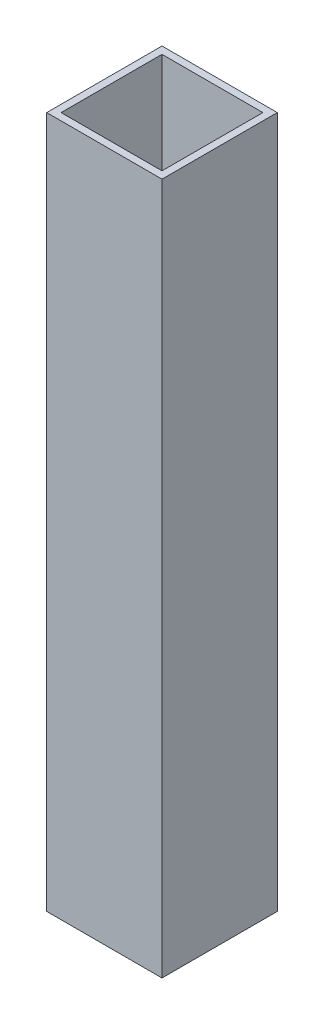
ISO-10303-21;
HEADER;
FILE_DESCRIPTION(('STEP AP214'),'2;1');
FILE_NAME('part.step','',(''),(''),'','','');
FILE_SCHEMA(('AUTOMOTIVE_DESIGN { 1 0 10303 214 1 1 1 1 }'));
ENDSEC;
DATA;
#1=APPLICATION_CONTEXT('core data for automotive mechanical design processes');
#2=APPLICATION_PROTOCOL_DEFINITION('international standard','automotive_design',2000,#1);
#3=PRODUCT_CONTEXT('',#1,'mechanical');
#4=PRODUCT('Part','Part','',(#3));
#5=PRODUCT_RELATED_PRODUCT_CATEGORY('part','',(#4));
#6=PRODUCT_DEFINITION_FORMATION('','',#4);
#7=PRODUCT_DEFINITION_CONTEXT('part definition',#1,'design');
#8=PRODUCT_DEFINITION('design','',#6,#7);
#9=PRODUCT_DEFINITION_SHAPE('','',#8);
#10=(LENGTH_UNIT() NAMED_UNIT(*) SI_UNIT(.MILLI.,.METRE.));
#11=(NAMED_UNIT(*) PLANE_ANGLE_UNIT() SI_UNIT($,.RADIAN.));
#12=(NAMED_UNIT(*) SI_UNIT($,.STERADIAN.) SOLID_ANGLE_UNIT());
#13=UNCERTAINTY_MEASURE_WITH_UNIT(LENGTH_MEASURE(1.E-05),#10,'distance_accuracy_value','');
#14=(GEOMETRIC_REPRESENTATION_CONTEXT(3) GLOBAL_UNCERTAINTY_ASSIGNED_CONTEXT((#13)) GLOBAL_UNIT_ASSIGNED_CONTEXT((#10,
#11,#12)) REPRESENTATION_CONTEXT('',''));
#15=CARTESIAN_POINT('',(0.,0.,0.));
#16=DIRECTION('',(0.,0.,1.));
#17=DIRECTION('',(1.,0.,0.));
#18=AXIS2_PLACEMENT_3D('',#15,#16,#17);
#19=CARTESIAN_POINT('',(0.,152.4,0.));
#20=DIRECTION('',(0.,1.,0.));
#21=DIRECTION('',(0.,0.,1.));
#22=AXIS2_PLACEMENT_3D('',#19,#20,#21);
#23=PLANE('',#22);
#24=DIRECTION('',(0.,0.,-1.));
#25=VECTOR('',#24,1.);
#26=CARTESIAN_POINT('',(12.7,152.4,-12.7));
#27=LINE('',#26,#25);
#28=CARTESIAN_POINT('',(12.7,152.4,12.7));
#29=VERTEX_POINT('',#28);
#30=CARTESIAN_POINT('',(12.7,152.4,-12.7));
#31=VERTEX_POINT('',#30);
#32=EDGE_CURVE('E136',#29,#31,#27,.T.);
#33=ORIENTED_EDGE('',*,*,#32,.T.);
#34=DIRECTION('',(-1.,0.,0.));
#35=VECTOR('',#34,1.);
#36=CARTESIAN_POINT('',(-12.7,152.4,-12.7));
#37=LINE('',#36,#35);
#38=CARTESIAN_POINT('',(-12.7,152.4,-12.7));
#39=VERTEX_POINT('',#38);
#40=EDGE_CURVE('E139',#31,#39,#37,.T.);
#41=ORIENTED_EDGE('',*,*,#40,.T.);
#42=DIRECTION('',(0.,0.,1.));
#43=VECTOR('',#42,1.);
#44=CARTESIAN_POINT('',(-12.7,152.4,-12.7));
#45=LINE('',#44,#43);
#46=CARTESIAN_POINT('',(-12.7,152.4,12.7));
#47=VERTEX_POINT('',#46);
#48=EDGE_CURVE('E142',#39,#47,#45,.T.);
#49=ORIENTED_EDGE('',*,*,#48,.T.);
#50=DIRECTION('',(1.,0.,0.));
#51=VECTOR('',#50,1.);
#52=CARTESIAN_POINT('',(-12.7,152.4,12.7));
#53=LINE('',#52,#51);
#54=EDGE_CURVE('E144',#47,#29,#53,.T.);
#55=ORIENTED_EDGE('',*,*,#54,.T.);
#56=EDGE_LOOP('',(#33,#41,#49,#55));
#57=FACE_BOUND('',#56,.T.);
#58=DIRECTION('',(0.,0.,1.));
#59=VECTOR('',#58,1.);
#60=CARTESIAN_POINT('',(-11.1125,152.4,-11.1125));
#61=LINE('',#60,#59);
#62=CARTESIAN_POINT('',(-11.1125,152.4,-11.1125));
#63=VERTEX_POINT('',#62);
#64=CARTESIAN_POINT('',(-11.1125,152.4,11.1125));
#65=VERTEX_POINT('',#64);
#66=EDGE_CURVE('E108',#63,#65,#61,.T.);
#67=ORIENTED_EDGE('',*,*,#66,.F.);
#68=DIRECTION('',(-1.,0.,0.));
#69=VECTOR('',#68,1.);
#70=CARTESIAN_POINT('',(-11.1125,152.4,-11.1125));
#71=LINE('',#70,#69);
#72=CARTESIAN_POINT('',(11.1125,152.4,-11.1125));
#73=VERTEX_POINT('',#72);
#74=EDGE_CURVE('E100',#73,#63,#71,.T.);
#75=ORIENTED_EDGE('',*,*,#74,.F.);
#76=DIRECTION('',(0.,0.,-1.));
#77=VECTOR('',#76,1.);
#78=CARTESIAN_POINT('',(11.1125,152.4,-11.1125));
#79=LINE('',#78,#77);
#80=CARTESIAN_POINT('',(11.1125,152.4,11.1125));
#81=VERTEX_POINT('',#80);
#82=EDGE_CURVE('E122',#81,#73,#79,.T.);
#83=ORIENTED_EDGE('',*,*,#82,.F.);
#84=DIRECTION('',(1.,0.,0.));
#85=VECTOR('',#84,1.);
#86=CARTESIAN_POINT('',(-11.1125,152.4,11.1125));
#87=LINE('',#86,#85);
#88=EDGE_CURVE('E120',#65,#81,#87,.T.);
#89=ORIENTED_EDGE('',*,*,#88,.F.);
#90=EDGE_LOOP('',(#67,#75,#83,#89));
#91=FACE_BOUND('',#90,.T.);
#92=ADVANCED_FACE('F35',(#57,#91),#23,.T.);
#93=CARTESIAN_POINT('',(0.,0.,0.));
#94=DIRECTION('',(0.,1.,0.));
#95=DIRECTION('',(0.,0.,1.));
#96=AXIS2_PLACEMENT_3D('',#93,#94,#95);
#97=PLANE('',#96);
#98=DIRECTION('',(0.,0.,-1.));
#99=VECTOR('',#98,1.);
#100=CARTESIAN_POINT('',(12.7,0.,-12.7));
#101=LINE('',#100,#99);
#102=CARTESIAN_POINT('',(12.7,0.,12.7));
#103=VERTEX_POINT('',#102);
#104=CARTESIAN_POINT('',(12.7,0.,-12.7));
#105=VERTEX_POINT('',#104);
#106=EDGE_CURVE('E116',#103,#105,#101,.T.);
#107=ORIENTED_EDGE('',*,*,#106,.F.);
#108=DIRECTION('',(1.,0.,0.));
#109=VECTOR('',#108,1.);
#110=CARTESIAN_POINT('',(-12.7,0.,12.7));
#111=LINE('',#110,#109);
#112=CARTESIAN_POINT('',(-12.7,0.,12.7));
#113=VERTEX_POINT('',#112);
#114=EDGE_CURVE('E140',#113,#103,#111,.T.);
#115=ORIENTED_EDGE('',*,*,#114,.F.);
#116=DIRECTION('',(0.,0.,1.));
#117=VECTOR('',#116,1.);
#118=CARTESIAN_POINT('',(-12.7,0.,-12.7));
#119=LINE('',#118,#117);
#120=CARTESIAN_POINT('',(-12.7,0.,-12.7));
#121=VERTEX_POINT('',#120);
#122=EDGE_CURVE('E151',#121,#113,#119,.T.);
#123=ORIENTED_EDGE('',*,*,#122,.F.);
#124=DIRECTION('',(-1.,0.,0.));
#125=VECTOR('',#124,1.);
#126=CARTESIAN_POINT('',(-12.7,0.,-12.7));
#127=LINE('',#126,#125);
#128=EDGE_CURVE('E149',#105,#121,#127,.T.);
#129=ORIENTED_EDGE('',*,*,#128,.F.);
#130=EDGE_LOOP('',(#107,#115,#123,#129));
#131=FACE_BOUND('',#130,.T.);
#132=DIRECTION('',(-1.,0.,0.));
#133=VECTOR('',#132,1.);
#134=CARTESIAN_POINT('',(-11.1125,0.,-11.1125));
#135=LINE('',#134,#133);
#136=CARTESIAN_POINT('',(11.1125,0.,-11.1125));
#137=VERTEX_POINT('',#136);
#138=CARTESIAN_POINT('',(-11.1125,0.,-11.1125));
#139=VERTEX_POINT('',#138);
#140=EDGE_CURVE('E58',#137,#139,#135,.T.);
#141=ORIENTED_EDGE('',*,*,#140,.T.);
#142=DIRECTION('',(0.,0.,1.));
#143=VECTOR('',#142,1.);
#144=CARTESIAN_POINT('',(-11.1125,0.,-11.1125));
#145=LINE('',#144,#143);
#146=CARTESIAN_POINT('',(-11.1125,0.,11.1125));
#147=VERTEX_POINT('',#146);
#148=EDGE_CURVE('E115',#139,#147,#145,.T.);
#149=ORIENTED_EDGE('',*,*,#148,.T.);
#150=DIRECTION('',(1.,0.,0.));
#151=VECTOR('',#150,1.);
#152=CARTESIAN_POINT('',(-11.1125,0.,11.1125));
#153=LINE('',#152,#151);
#154=CARTESIAN_POINT('',(11.1125,0.,11.1125));
#155=VERTEX_POINT('',#154);
#156=EDGE_CURVE('E128',#147,#155,#153,.T.);
#157=ORIENTED_EDGE('',*,*,#156,.T.);
#158=DIRECTION('',(0.,0.,-1.));
#159=VECTOR('',#158,1.);
#160=CARTESIAN_POINT('',(11.1125,0.,-11.1125));
#161=LINE('',#160,#159);
#162=EDGE_CURVE('E109',#155,#137,#161,.T.);
#163=ORIENTED_EDGE('',*,*,#162,.T.);
#164=EDGE_LOOP('',(#141,#149,#157,#163));
#165=FACE_BOUND('',#164,.T.);
#166=ADVANCED_FACE('F169',(#131,#165),#97,.F.);
#167=CARTESIAN_POINT('',(12.7,152.4,-12.7));
#168=DIRECTION('',(-1.,0.,0.));
#169=DIRECTION('',(0.,0.,1.));
#170=AXIS2_PLACEMENT_3D('',#167,#168,#169);
#171=PLANE('',#170);
#172=ORIENTED_EDGE('',*,*,#106,.T.);
#173=DIRECTION('',(0.,-1.,0.));
#174=VECTOR('',#173,1.);
#175=CARTESIAN_POINT('',(12.7,152.4,-12.7));
#176=LINE('',#175,#174);
#177=EDGE_CURVE('E11',#31,#105,#176,.T.);
#178=ORIENTED_EDGE('',*,*,#177,.F.);
#179=ORIENTED_EDGE('',*,*,#32,.F.);
#180=DIRECTION('',(0.,-1.,0.));
#181=VECTOR('',#180,1.);
#182=CARTESIAN_POINT('',(12.7,152.4,12.7));
#183=LINE('',#182,#181);
#184=EDGE_CURVE('E146',#29,#103,#183,.T.);
#185=ORIENTED_EDGE('',*,*,#184,.T.);
#186=EDGE_LOOP('',(#172,#178,#179,#185));
#187=FACE_BOUND('',#186,.T.);
#188=ADVANCED_FACE('F37',(#187),#171,.F.);
#189=CARTESIAN_POINT('',(-12.7,152.4,-12.7));
#190=DIRECTION('',(0.,0.,1.));
#191=DIRECTION('',(1.,0.,0.));
#192=AXIS2_PLACEMENT_3D('',#189,#190,#191);
#193=PLANE('',#192);
#194=ORIENTED_EDGE('',*,*,#128,.T.);
#195=DIRECTION('',(0.,-1.,0.));
#196=VECTOR('',#195,1.);
#197=CARTESIAN_POINT('',(-12.7,152.4,-12.7));
#198=LINE('',#197,#196);
#199=EDGE_CURVE('E43',#39,#121,#198,.T.);
#200=ORIENTED_EDGE('',*,*,#199,.F.);
#201=ORIENTED_EDGE('',*,*,#40,.F.);
#202=ORIENTED_EDGE('',*,*,#177,.T.);
#203=EDGE_LOOP('',(#194,#200,#201,#202));
#204=FACE_BOUND('',#203,.T.);
#205=ADVANCED_FACE('F179',(#204),#193,.F.);
#206=CARTESIAN_POINT('',(-12.7,152.4,-12.7));
#207=DIRECTION('',(1.,0.,0.));
#208=DIRECTION('',(0.,0.,-1.));
#209=AXIS2_PLACEMENT_3D('',#206,#207,#208);
#210=PLANE('',#209);
#211=ORIENTED_EDGE('',*,*,#122,.T.);
#212=DIRECTION('',(0.,-1.,0.));
#213=VECTOR('',#212,1.);
#214=CARTESIAN_POINT('',(-12.7,152.4,12.7));
#215=LINE('',#214,#213);
#216=EDGE_CURVE('E156',#47,#113,#215,.T.);
#217=ORIENTED_EDGE('',*,*,#216,.F.);
#218=ORIENTED_EDGE('',*,*,#48,.F.);
#219=ORIENTED_EDGE('',*,*,#199,.T.);
#220=EDGE_LOOP('',(#211,#217,#218,#219));
#221=FACE_BOUND('',#220,.T.);
#222=ADVANCED_FACE('F163',(#221),#210,.F.);
#223=CARTESIAN_POINT('',(-12.7,152.4,12.7));
#224=DIRECTION('',(0.,0.,-1.));
#225=DIRECTION('',(-1.,0.,0.));
#226=AXIS2_PLACEMENT_3D('',#223,#224,#225);
#227=PLANE('',#226);
#228=ORIENTED_EDGE('',*,*,#114,.T.);
#229=ORIENTED_EDGE('',*,*,#184,.F.);
#230=ORIENTED_EDGE('',*,*,#54,.F.);
#231=ORIENTED_EDGE('',*,*,#216,.T.);
#232=EDGE_LOOP('',(#228,#229,#230,#231));
#233=FACE_BOUND('',#232,.T.);
#234=ADVANCED_FACE('F173',(#233),#227,.F.);
#235=CARTESIAN_POINT('',(-11.1125,152.4,-11.1125));
#236=DIRECTION('',(0.,0.,1.));
#237=DIRECTION('',(1.,0.,0.));
#238=AXIS2_PLACEMENT_3D('',#235,#236,#237);
#239=PLANE('',#238);
#240=ORIENTED_EDGE('',*,*,#140,.F.);
#241=DIRECTION('',(0.,-1.,0.));
#242=VECTOR('',#241,1.);
#243=CARTESIAN_POINT('',(11.1125,152.4,-11.1125));
#244=LINE('',#243,#242);
#245=EDGE_CURVE('E104',#73,#137,#244,.T.);
#246=ORIENTED_EDGE('',*,*,#245,.F.);
#247=ORIENTED_EDGE('',*,*,#74,.T.);
#248=DIRECTION('',(0.,-1.,0.));
#249=VECTOR('',#248,1.);
#250=CARTESIAN_POINT('',(-11.1125,152.4,-11.1125));
#251=LINE('',#250,#249);
#252=EDGE_CURVE('E103',#63,#139,#251,.T.);
#253=ORIENTED_EDGE('',*,*,#252,.T.);
#254=EDGE_LOOP('',(#240,#246,#247,#253));
#255=FACE_BOUND('',#254,.T.);
#256=ADVANCED_FACE('F102',(#255),#239,.T.);
#257=CARTESIAN_POINT('',(-11.1125,152.4,-11.1125));
#258=DIRECTION('',(1.,0.,0.));
#259=DIRECTION('',(0.,0.,-1.));
#260=AXIS2_PLACEMENT_3D('',#257,#258,#259);
#261=PLANE('',#260);
#262=ORIENTED_EDGE('',*,*,#148,.F.);
#263=ORIENTED_EDGE('',*,*,#252,.F.);
#264=ORIENTED_EDGE('',*,*,#66,.T.);
#265=DIRECTION('',(0.,-1.,0.));
#266=VECTOR('',#265,1.);
#267=CARTESIAN_POINT('',(-11.1125,152.4,11.1125));
#268=LINE('',#267,#266);
#269=EDGE_CURVE('E117',#65,#147,#268,.T.);
#270=ORIENTED_EDGE('',*,*,#269,.T.);
#271=EDGE_LOOP('',(#262,#263,#264,#270));
#272=FACE_BOUND('',#271,.T.);
#273=ADVANCED_FACE('F112',(#272),#261,.T.);
#274=CARTESIAN_POINT('',(-11.1125,152.4,11.1125));
#275=DIRECTION('',(0.,0.,-1.));
#276=DIRECTION('',(-1.,0.,0.));
#277=AXIS2_PLACEMENT_3D('',#274,#275,#276);
#278=PLANE('',#277);
#279=ORIENTED_EDGE('',*,*,#156,.F.);
#280=ORIENTED_EDGE('',*,*,#269,.F.);
#281=ORIENTED_EDGE('',*,*,#88,.T.);
#282=DIRECTION('',(0.,-1.,0.));
#283=VECTOR('',#282,1.);
#284=CARTESIAN_POINT('',(11.1125,152.4,11.1125));
#285=LINE('',#284,#283);
#286=EDGE_CURVE('E50',#81,#155,#285,.T.);
#287=ORIENTED_EDGE('',*,*,#286,.T.);
#288=EDGE_LOOP('',(#279,#280,#281,#287));
#289=FACE_BOUND('',#288,.T.);
#290=ADVANCED_FACE('F202',(#289),#278,.T.);
#291=CARTESIAN_POINT('',(11.1125,152.4,-11.1125));
#292=DIRECTION('',(-1.,0.,0.));
#293=DIRECTION('',(0.,0.,1.));
#294=AXIS2_PLACEMENT_3D('',#291,#292,#293);
#295=PLANE('',#294);
#296=ORIENTED_EDGE('',*,*,#162,.F.);
#297=ORIENTED_EDGE('',*,*,#286,.F.);
#298=ORIENTED_EDGE('',*,*,#82,.T.);
#299=ORIENTED_EDGE('',*,*,#245,.T.);
#300=EDGE_LOOP('',(#296,#297,#298,#299));
#301=FACE_BOUND('',#300,.T.);
#302=ADVANCED_FACE('F206',(#301),#295,.T.);
#303=CLOSED_SHELL('',(#92,#166,#188,#205,#222,#234,#256,#273,#290,#302));
#304=MANIFOLD_SOLID_BREP('B2',#303);
#305=ADVANCED_BREP_SHAPE_REPRESENTATION('',(#18,#304),#14);
#306=SHAPE_DEFINITION_REPRESENTATION(#9,#305);
ENDSEC;
END-ISO-10303-21;
